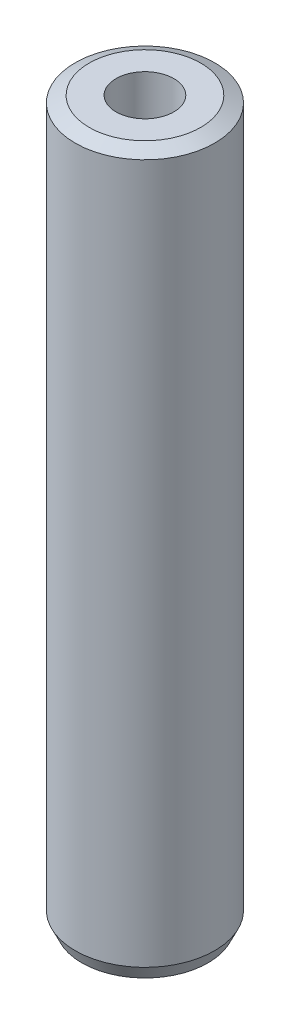
ISO-10303-21;
HEADER;
FILE_DESCRIPTION(('STEP AP214'),'2;1');
FILE_NAME('part.step','',(''),(''),'','','');
FILE_SCHEMA(('AUTOMOTIVE_DESIGN { 1 0 10303 214 1 1 1 1 }'));
ENDSEC;
DATA;
#1=APPLICATION_CONTEXT('core data for automotive mechanical design processes');
#2=APPLICATION_PROTOCOL_DEFINITION('international standard','automotive_design',2000,#1);
#3=PRODUCT_CONTEXT('',#1,'mechanical');
#4=PRODUCT('Part','Part','',(#3));
#5=PRODUCT_RELATED_PRODUCT_CATEGORY('part','',(#4));
#6=PRODUCT_DEFINITION_FORMATION('','',#4);
#7=PRODUCT_DEFINITION_CONTEXT('part definition',#1,'design');
#8=PRODUCT_DEFINITION('design','',#6,#7);
#9=PRODUCT_DEFINITION_SHAPE('','',#8);
#10=(LENGTH_UNIT() NAMED_UNIT(*) SI_UNIT(.MILLI.,.METRE.));
#11=(NAMED_UNIT(*) PLANE_ANGLE_UNIT() SI_UNIT($,.RADIAN.));
#12=(NAMED_UNIT(*) SI_UNIT($,.STERADIAN.) SOLID_ANGLE_UNIT());
#13=UNCERTAINTY_MEASURE_WITH_UNIT(LENGTH_MEASURE(1.E-05),#10,'distance_accuracy_value','');
#14=(GEOMETRIC_REPRESENTATION_CONTEXT(3) GLOBAL_UNCERTAINTY_ASSIGNED_CONTEXT((#13)) GLOBAL_UNIT_ASSIGNED_CONTEXT((#10,
#11,#12)) REPRESENTATION_CONTEXT('',''));
#15=CARTESIAN_POINT('',(0.,0.,0.));
#16=DIRECTION('',(0.,0.,1.));
#17=DIRECTION('',(1.,0.,0.));
#18=AXIS2_PLACEMENT_3D('',#15,#16,#17);
#19=CARTESIAN_POINT('',(0.,361.422392352215,0.));
#20=DIRECTION('',(0.,-1.,0.));
#21=DIRECTION('',(0.,0.,-1.));
#22=AXIS2_PLACEMENT_3D('',#19,#20,#21);
#23=CYLINDRICAL_SURFACE('',#22,35.);
#24=CARTESIAN_POINT('',(0.,358.084624537625,0.));
#25=DIRECTION('',(0.,1.,0.));
#26=DIRECTION('',(0.,0.,1.));
#27=AXIS2_PLACEMENT_3D('',#24,#25,#26);
#28=CIRCLE('',#27,35.);
#29=CARTESIAN_POINT('',(0.,358.084624537625,35.));
#30=VERTEX_POINT('',#29);
#31=EDGE_CURVE('E50',#30,#30,#28,.F.);
#32=ORIENTED_EDGE('',*,*,#31,.T.);
#33=EDGE_LOOP('',(#32));
#34=FACE_BOUND('',#33,.T.);
#35=CARTESIAN_POINT('',(0.,6.99845417209222,0.));
#36=DIRECTION('',(0.,1.,0.));
#37=DIRECTION('',(0.,0.,1.));
#38=AXIS2_PLACEMENT_3D('',#35,#36,#37);
#39=CIRCLE('',#38,35.);
#40=CARTESIAN_POINT('',(0.,6.99845417209222,35.));
#41=VERTEX_POINT('',#40);
#42=EDGE_CURVE('E51',#41,#41,#39,.T.);
#43=ORIENTED_EDGE('',*,*,#42,.T.);
#44=EDGE_LOOP('',(#43));
#45=FACE_BOUND('',#44,.T.);
#46=ADVANCED_FACE('F39',(#34,#45),#23,.T.);
#47=CARTESIAN_POINT('',(0.,361.422392352215,0.));
#48=DIRECTION('',(0.,1.,0.));
#49=DIRECTION('',(0.,0.,1.));
#50=AXIS2_PLACEMENT_3D('',#47,#48,#49);
#51=PLANE('',#50);
#52=CARTESIAN_POINT('',(0.,361.422392352215,0.));
#53=DIRECTION('',(0.,1.,0.));
#54=DIRECTION('',(0.,0.,1.));
#55=AXIS2_PLACEMENT_3D('',#52,#53,#54);
#56=CIRCLE('',#55,28.0015458279079);
#57=CARTESIAN_POINT('',(0.,361.422392352215,28.0015458279079));
#58=VERTEX_POINT('',#57);
#59=EDGE_CURVE('E54',#58,#58,#56,.T.);
#60=ORIENTED_EDGE('',*,*,#59,.T.);
#61=EDGE_LOOP('',(#60));
#62=FACE_BOUND('',#61,.T.);
#63=CARTESIAN_POINT('',(0.,361.422392352215,0.));
#64=DIRECTION('',(0.,1.,0.));
#65=DIRECTION('',(0.,0.,1.));
#66=AXIS2_PLACEMENT_3D('',#63,#64,#65);
#67=CIRCLE('',#66,14.5098812105122);
#68=CARTESIAN_POINT('',(0.,361.422392352215,14.5098812105122));
#69=VERTEX_POINT('',#68);
#70=EDGE_CURVE('E58',#69,#69,#67,.T.);
#71=ORIENTED_EDGE('',*,*,#70,.F.);
#72=EDGE_LOOP('',(#71));
#73=FACE_BOUND('',#72,.T.);
#74=ADVANCED_FACE('F69',(#62,#73),#51,.T.);
#75=CARTESIAN_POINT('',(0.,0.,0.));
#76=DIRECTION('',(0.,1.,0.));
#77=DIRECTION('',(0.,0.,1.));
#78=AXIS2_PLACEMENT_3D('',#75,#76,#77);
#79=PLANE('',#78);
#80=CARTESIAN_POINT('',(0.,0.,0.));
#81=DIRECTION('',(0.,1.,0.));
#82=DIRECTION('',(0.,0.,1.));
#83=AXIS2_PLACEMENT_3D('',#80,#81,#82);
#84=CIRCLE('',#83,31.6622321854103);
#85=CARTESIAN_POINT('',(0.,0.,31.6622321854103));
#86=VERTEX_POINT('',#85);
#87=EDGE_CURVE('E10',#86,#86,#84,.F.);
#88=ORIENTED_EDGE('',*,*,#87,.T.);
#89=EDGE_LOOP('',(#88));
#90=FACE_BOUND('',#89,.T.);
#91=CARTESIAN_POINT('',(0.,0.,0.));
#92=DIRECTION('',(0.,1.,0.));
#93=DIRECTION('',(0.,0.,1.));
#94=AXIS2_PLACEMENT_3D('',#91,#92,#93);
#95=CIRCLE('',#94,14.5098812105122);
#96=CARTESIAN_POINT('',(0.,0.,14.5098812105122));
#97=VERTEX_POINT('',#96);
#98=EDGE_CURVE('E63',#97,#97,#95,.T.);
#99=ORIENTED_EDGE('',*,*,#98,.T.);
#100=EDGE_LOOP('',(#99));
#101=FACE_BOUND('',#100,.T.);
#102=ADVANCED_FACE('F75',(#90,#101),#79,.F.);
#103=CARTESIAN_POINT('',(0.,361.422392352215,0.));
#104=DIRECTION('',(0.,-1.,0.));
#105=DIRECTION('',(0.,0.,-1.));
#106=AXIS2_PLACEMENT_3D('',#103,#104,#105);
#107=CYLINDRICAL_SURFACE('',#106,14.5098812105122);
#108=ORIENTED_EDGE('',*,*,#70,.T.);
#109=EDGE_LOOP('',(#108));
#110=FACE_BOUND('',#109,.T.);
#111=ORIENTED_EDGE('',*,*,#98,.F.);
#112=EDGE_LOOP('',(#111));
#113=FACE_BOUND('',#112,.T.);
#114=ADVANCED_FACE('F70',(#110,#113),#107,.F.);
#115=CARTESIAN_POINT('',(0.,361.422392352215,0.));
#116=DIRECTION('',(0.,-1.,0.));
#117=DIRECTION('',(0.,0.,-1.));
#118=AXIS2_PLACEMENT_3D('',#115,#116,#117);
#119=CONICAL_SURFACE('',#118,28.0015458279079,1.12577503620159);
#120=ORIENTED_EDGE('',*,*,#31,.F.);
#121=EDGE_LOOP('',(#120));
#122=FACE_BOUND('',#121,.T.);
#123=ORIENTED_EDGE('',*,*,#59,.F.);
#124=EDGE_LOOP('',(#123));
#125=FACE_BOUND('',#124,.T.);
#126=ADVANCED_FACE('F81',(#122,#125),#119,.T.);
#127=CARTESIAN_POINT('',(0.,6.99845417209222,0.));
#128=DIRECTION('',(0.,1.,0.));
#129=DIRECTION('',(0.,0.,1.));
#130=AXIS2_PLACEMENT_3D('',#127,#128,#129);
#131=CONICAL_SURFACE('',#130,35.,0.44502129059331);
#132=ORIENTED_EDGE('',*,*,#87,.F.);
#133=EDGE_LOOP('',(#132));
#134=FACE_BOUND('',#133,.T.);
#135=ORIENTED_EDGE('',*,*,#42,.F.);
#136=EDGE_LOOP('',(#135));
#137=FACE_BOUND('',#136,.T.);
#138=ADVANCED_FACE('F45',(#134,#137),#131,.T.);
#139=CLOSED_SHELL('',(#46,#74,#102,#114,#126,#138));
#140=MANIFOLD_SOLID_BREP('B2',#139);
#141=ADVANCED_BREP_SHAPE_REPRESENTATION('',(#18,#140),#14);
#142=SHAPE_DEFINITION_REPRESENTATION(#9,#141);
ENDSEC;
END-ISO-10303-21;
